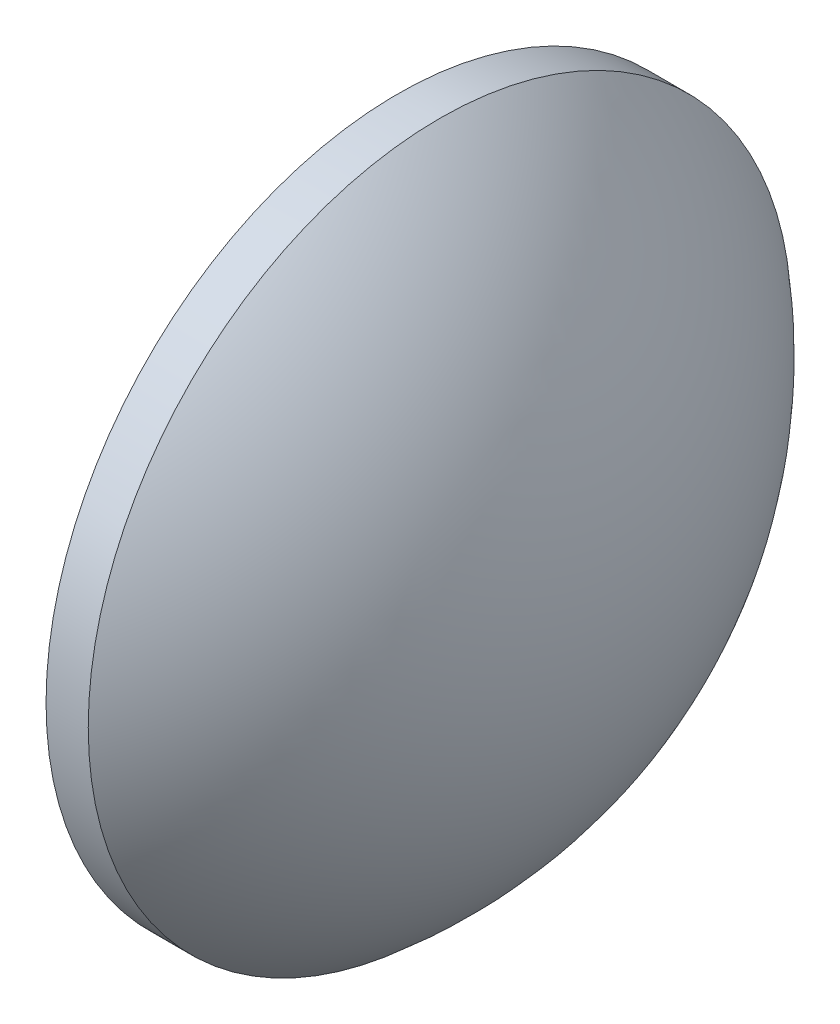
ISO-10303-21;
HEADER;
FILE_DESCRIPTION(('STEP AP214'),'2;1');
FILE_NAME('part.step','',(''),(''),'','','');
FILE_SCHEMA(('AUTOMOTIVE_DESIGN { 1 0 10303 214 1 1 1 1 }'));
ENDSEC;
DATA;
#1=APPLICATION_CONTEXT('core data for automotive mechanical design processes');
#2=APPLICATION_PROTOCOL_DEFINITION('international standard','automotive_design',2000,#1);
#3=PRODUCT_CONTEXT('',#1,'mechanical');
#4=PRODUCT('Part','Part','',(#3));
#5=PRODUCT_RELATED_PRODUCT_CATEGORY('part','',(#4));
#6=PRODUCT_DEFINITION_FORMATION('','',#4);
#7=PRODUCT_DEFINITION_CONTEXT('part definition',#1,'design');
#8=PRODUCT_DEFINITION('design','',#6,#7);
#9=PRODUCT_DEFINITION_SHAPE('','',#8);
#10=(LENGTH_UNIT() NAMED_UNIT(*) SI_UNIT(.MILLI.,.METRE.));
#11=(NAMED_UNIT(*) PLANE_ANGLE_UNIT() SI_UNIT($,.RADIAN.));
#12=(NAMED_UNIT(*) SI_UNIT($,.STERADIAN.) SOLID_ANGLE_UNIT());
#13=UNCERTAINTY_MEASURE_WITH_UNIT(LENGTH_MEASURE(1.E-05),#10,'distance_accuracy_value','');
#14=(GEOMETRIC_REPRESENTATION_CONTEXT(3) GLOBAL_UNCERTAINTY_ASSIGNED_CONTEXT((#13)) GLOBAL_UNIT_ASSIGNED_CONTEXT((#10,
#11,#12)) REPRESENTATION_CONTEXT('',''));
#15=CARTESIAN_POINT('',(0.,0.,0.));
#16=DIRECTION('',(0.,0.,1.));
#17=DIRECTION('',(1.,0.,0.));
#18=AXIS2_PLACEMENT_3D('',#15,#16,#17);
#19=CARTESIAN_POINT('',(421.334330910872,106.670754481527,0.));
#20=DIRECTION('',(-1.,0.,0.));
#21=DIRECTION('',(0.,1.,0.));
#22=AXIS2_PLACEMENT_3D('',#19,#20,#21);
#23=SPHERICAL_SURFACE('',#22,32.5060912190964);
#24=CARTESIAN_POINT('',(442.110422129968,106.670754481527,0.));
#25=DIRECTION('',(-1.,0.,0.));
#26=DIRECTION('',(0.,0.,1.));
#27=AXIS2_PLACEMENT_3D('',#24,#25,#26);
#28=CIRCLE('',#27,25.);
#29=CARTESIAN_POINT('',(442.110422129968,106.670754481527,25.));
#30=VERTEX_POINT('',#29);
#31=EDGE_CURVE('E10',#30,#30,#28,.T.);
#32=ORIENTED_EDGE('',*,*,#31,.F.);
#33=EDGE_LOOP('',(#32));
#34=FACE_BOUND('',#33,.T.);
#35=ADVANCED_FACE('F35',(#34),#23,.T.);
#36=CARTESIAN_POINT('',(429.688182692781,106.670754481527,0.));
#37=DIRECTION('',(-1.,0.,0.));
#38=DIRECTION('',(0.,0.,1.));
#39=AXIS2_PLACEMENT_3D('',#36,#37,#38);
#40=CYLINDRICAL_SURFACE('',#39,25.);
#41=CARTESIAN_POINT('',(439.110422129968,106.670754481527,0.));
#42=DIRECTION('',(-1.,0.,0.));
#43=DIRECTION('',(0.,0.,1.));
#44=AXIS2_PLACEMENT_3D('',#41,#42,#43);
#45=CIRCLE('',#44,25.);
#46=CARTESIAN_POINT('',(439.110422129968,106.670754481527,25.));
#47=VERTEX_POINT('',#46);
#48=EDGE_CURVE('E41',#47,#47,#45,.T.);
#49=ORIENTED_EDGE('',*,*,#48,.F.);
#50=EDGE_LOOP('',(#49));
#51=FACE_BOUND('',#50,.T.);
#52=ORIENTED_EDGE('',*,*,#31,.T.);
#53=EDGE_LOOP('',(#52));
#54=FACE_BOUND('',#53,.T.);
#55=ADVANCED_FACE('F49',(#51,#54),#40,.T.);
#56=CARTESIAN_POINT('',(439.110422129968,106.670754481527,0.));
#57=DIRECTION('',(1.,0.,0.));
#58=DIRECTION('',(0.,0.,-1.));
#59=AXIS2_PLACEMENT_3D('',#56,#57,#58);
#60=PLANE('',#59);
#61=ORIENTED_EDGE('',*,*,#48,.T.);
#62=EDGE_LOOP('',(#61));
#63=FACE_BOUND('',#62,.T.);
#64=ADVANCED_FACE('F47',(#63),#60,.F.);
#65=CLOSED_SHELL('',(#35,#55,#64));
#66=MANIFOLD_SOLID_BREP('B2',#65);
#67=ADVANCED_BREP_SHAPE_REPRESENTATION('',(#18,#66),#14);
#68=SHAPE_DEFINITION_REPRESENTATION(#9,#67);
ENDSEC;
END-ISO-10303-21;
